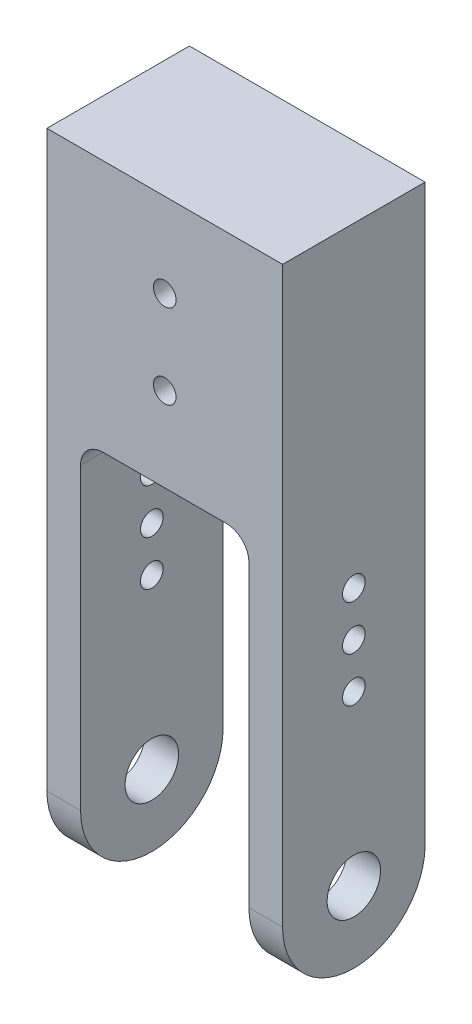
ISO-10303-21;
HEADER;
FILE_DESCRIPTION(('STEP AP214'),'2;1');
FILE_NAME('part.step','',(''),(''),'','','');
FILE_SCHEMA(('AUTOMOTIVE_DESIGN { 1 0 10303 214 1 1 1 1 }'));
ENDSEC;
DATA;
#1=APPLICATION_CONTEXT('core data for automotive mechanical design processes');
#2=APPLICATION_PROTOCOL_DEFINITION('international standard','automotive_design',2000,#1);
#3=PRODUCT_CONTEXT('',#1,'mechanical');
#4=PRODUCT('Part','Part','',(#3));
#5=PRODUCT_RELATED_PRODUCT_CATEGORY('part','',(#4));
#6=PRODUCT_DEFINITION_FORMATION('','',#4);
#7=PRODUCT_DEFINITION_CONTEXT('part definition',#1,'design');
#8=PRODUCT_DEFINITION('design','',#6,#7);
#9=PRODUCT_DEFINITION_SHAPE('','',#8);
#10=(LENGTH_UNIT() NAMED_UNIT(*) SI_UNIT(.MILLI.,.METRE.));
#11=(NAMED_UNIT(*) PLANE_ANGLE_UNIT() SI_UNIT($,.RADIAN.));
#12=(NAMED_UNIT(*) SI_UNIT($,.STERADIAN.) SOLID_ANGLE_UNIT());
#13=UNCERTAINTY_MEASURE_WITH_UNIT(LENGTH_MEASURE(1.E-05),#10,'distance_accuracy_value','');
#14=(GEOMETRIC_REPRESENTATION_CONTEXT(3) GLOBAL_UNCERTAINTY_ASSIGNED_CONTEXT((#13)) GLOBAL_UNIT_ASSIGNED_CONTEXT((#10,
#11,#12)) REPRESENTATION_CONTEXT('',''));
#15=CARTESIAN_POINT('',(0.,0.,0.));
#16=DIRECTION('',(0.,0.,1.));
#17=DIRECTION('',(1.,0.,0.));
#18=AXIS2_PLACEMENT_3D('',#15,#16,#17);
#19=CARTESIAN_POINT('',(21.,0.,-12.7));
#20=DIRECTION('',(0.,-1.,0.));
#21=DIRECTION('',(0.,0.,-1.));
#22=AXIS2_PLACEMENT_3D('',#19,#20,#21);
#23=PLANE('',#22);
#24=DIRECTION('',(-1.,0.,0.));
#25=VECTOR('',#24,1.);
#26=CARTESIAN_POINT('',(-21.,0.,-12.7));
#27=LINE('',#26,#25);
#28=CARTESIAN_POINT('',(11.,0.,-12.7));
#29=VERTEX_POINT('',#28);
#30=CARTESIAN_POINT('',(-11.,0.,-12.7));
#31=VERTEX_POINT('',#30);
#32=EDGE_CURVE('E175',#29,#31,#27,.T.);
#33=ORIENTED_EDGE('',*,*,#32,.F.);
#34=DIRECTION('',(0.,0.,-1.));
#35=VECTOR('',#34,1.);
#36=CARTESIAN_POINT('',(11.,0.,-12.7));
#37=LINE('',#36,#35);
#38=CARTESIAN_POINT('',(11.,0.,12.7));
#39=VERTEX_POINT('',#38);
#40=EDGE_CURVE('E258',#29,#39,#37,.F.);
#41=ORIENTED_EDGE('',*,*,#40,.T.);
#42=DIRECTION('',(1.,0.,0.));
#43=VECTOR('',#42,1.);
#44=CARTESIAN_POINT('',(-21.,0.,12.7));
#45=LINE('',#44,#43);
#46=CARTESIAN_POINT('',(-11.,0.,12.7));
#47=VERTEX_POINT('',#46);
#48=EDGE_CURVE('E253',#47,#39,#45,.T.);
#49=ORIENTED_EDGE('',*,*,#48,.F.);
#50=DIRECTION('',(0.,0.,1.));
#51=VECTOR('',#50,1.);
#52=CARTESIAN_POINT('',(-11.,0.,-12.7));
#53=LINE('',#52,#51);
#54=EDGE_CURVE('E256',#47,#31,#53,.F.);
#55=ORIENTED_EDGE('',*,*,#54,.T.);
#56=EDGE_LOOP('',(#33,#41,#49,#55));
#57=FACE_BOUND('',#56,.T.);
#58=ADVANCED_FACE('F34',(#57),#23,.T.);
#59=CARTESIAN_POINT('',(21.,70.,12.7));
#60=DIRECTION('',(-1.,0.,0.));
#61=DIRECTION('',(0.,0.,1.));
#62=AXIS2_PLACEMENT_3D('',#59,#60,#61);
#63=PLANE('',#62);
#64=CARTESIAN_POINT('',(21.,-11.3,0.));
#65=DIRECTION('',(1.,0.,0.));
#66=DIRECTION('',(0.,0.,-1.));
#67=AXIS2_PLACEMENT_3D('',#64,#65,#66);
#68=CIRCLE('',#67,2.01929999999999);
#69=CARTESIAN_POINT('',(21.,-11.3,-2.01929999999999));
#70=VERTEX_POINT('',#69);
#71=EDGE_CURVE('E573',#70,#70,#68,.T.);
#72=ORIENTED_EDGE('',*,*,#71,.F.);
#73=EDGE_LOOP('',(#72));
#74=FACE_BOUND('',#73,.T.);
#75=CARTESIAN_POINT('',(21.,-19.3,0.));
#76=DIRECTION('',(1.,0.,0.));
#77=DIRECTION('',(0.,0.,-1.));
#78=AXIS2_PLACEMENT_3D('',#75,#76,#77);
#79=CIRCLE('',#78,2.01929999999999);
#80=CARTESIAN_POINT('',(21.,-19.3,-2.01929999999999));
#81=VERTEX_POINT('',#80);
#82=EDGE_CURVE('E205',#81,#81,#79,.T.);
#83=ORIENTED_EDGE('',*,*,#82,.F.);
#84=EDGE_LOOP('',(#83));
#85=FACE_BOUND('',#84,.T.);
#86=CARTESIAN_POINT('',(21.,-27.3,0.));
#87=DIRECTION('',(1.,0.,0.));
#88=DIRECTION('',(0.,0.,-1.));
#89=AXIS2_PLACEMENT_3D('',#86,#87,#88);
#90=CIRCLE('',#89,2.01929999999999);
#91=CARTESIAN_POINT('',(21.,-27.3,-2.01929999999999));
#92=VERTEX_POINT('',#91);
#93=EDGE_CURVE('E202',#92,#92,#90,.T.);
#94=ORIENTED_EDGE('',*,*,#93,.F.);
#95=EDGE_LOOP('',(#94));
#96=FACE_BOUND('',#95,.T.);
#97=CARTESIAN_POINT('',(21.,-57.3,0.));
#98=DIRECTION('',(-1.,0.,0.));
#99=DIRECTION('',(0.,0.,1.));
#100=AXIS2_PLACEMENT_3D('',#97,#98,#99);
#101=CIRCLE('',#100,4.7625);
#102=CARTESIAN_POINT('',(21.,-57.3,4.7625));
#103=VERTEX_POINT('',#102);
#104=EDGE_CURVE('E234',#103,#103,#101,.T.);
#105=ORIENTED_EDGE('',*,*,#104,.T.);
#106=EDGE_LOOP('',(#105));
#107=FACE_BOUND('',#106,.T.);
#108=DIRECTION('',(0.,-1.,0.));
#109=VECTOR('',#108,1.);
#110=CARTESIAN_POINT('',(21.,70.,-12.7));
#111=LINE('',#110,#109);
#112=CARTESIAN_POINT('',(21.,45.,-12.7));
#113=VERTEX_POINT('',#112);
#114=CARTESIAN_POINT('',(21.,-57.3,-12.7));
#115=VERTEX_POINT('',#114);
#116=EDGE_CURVE('E143',#113,#115,#111,.T.);
#117=ORIENTED_EDGE('',*,*,#116,.F.);
#118=DIRECTION('',(0.,0.,1.));
#119=VECTOR('',#118,1.);
#120=CARTESIAN_POINT('',(21.,45.,-12.7));
#121=LINE('',#120,#119);
#122=CARTESIAN_POINT('',(21.,45.,12.7));
#123=VERTEX_POINT('',#122);
#124=EDGE_CURVE('E124',#113,#123,#121,.T.);
#125=ORIENTED_EDGE('',*,*,#124,.T.);
#126=DIRECTION('',(0.,-1.,0.));
#127=VECTOR('',#126,1.);
#128=CARTESIAN_POINT('',(21.,70.,12.7));
#129=LINE('',#128,#127);
#130=CARTESIAN_POINT('',(21.,-57.3,12.7));
#131=VERTEX_POINT('',#130);
#132=EDGE_CURVE('E147',#123,#131,#129,.T.);
#133=ORIENTED_EDGE('',*,*,#132,.T.);
#134=CARTESIAN_POINT('',(21.,-57.3,0.));
#135=DIRECTION('',(-1.,0.,0.));
#136=DIRECTION('',(0.,0.,1.));
#137=AXIS2_PLACEMENT_3D('',#134,#135,#136);
#138=CIRCLE('',#137,12.7);
#139=CARTESIAN_POINT('',(21.,-70.,0.));
#140=VERTEX_POINT('',#139);
#141=EDGE_CURVE('E172',#131,#140,#138,.F.);
#142=ORIENTED_EDGE('',*,*,#141,.T.);
#143=CARTESIAN_POINT('',(21.,-57.3,0.));
#144=DIRECTION('',(-1.,0.,0.));
#145=DIRECTION('',(0.,0.,1.));
#146=AXIS2_PLACEMENT_3D('',#143,#144,#145);
#147=CIRCLE('',#146,12.7);
#148=EDGE_CURVE('E169',#140,#115,#147,.F.);
#149=ORIENTED_EDGE('',*,*,#148,.T.);
#150=EDGE_LOOP('',(#117,#125,#133,#142,#149));
#151=FACE_BOUND('',#150,.T.);
#152=ADVANCED_FACE('F292',(#74,#85,#96,#107,#151),#63,.F.);
#153=CARTESIAN_POINT('',(-21.,70.,-12.7));
#154=DIRECTION('',(0.,0.,1.));
#155=DIRECTION('',(1.,0.,0.));
#156=AXIS2_PLACEMENT_3D('',#153,#154,#155);
#157=PLANE('',#156);
#158=CARTESIAN_POINT('',(0.,30.,-12.7));
#159=DIRECTION('',(0.,0.,1.));
#160=DIRECTION('',(1.,0.,0.));
#161=AXIS2_PLACEMENT_3D('',#158,#159,#160);
#162=CIRCLE('',#161,2.01929999999999);
#163=CARTESIAN_POINT('',(2.0193,30.,-12.7));
#164=VERTEX_POINT('',#163);
#165=EDGE_CURVE('E224',#164,#164,#162,.T.);
#166=ORIENTED_EDGE('',*,*,#165,.T.);
#167=EDGE_LOOP('',(#166));
#168=FACE_BOUND('',#167,.T.);
#169=CARTESIAN_POINT('',(0.,15.,-12.7));
#170=DIRECTION('',(0.,0.,1.));
#171=DIRECTION('',(1.,0.,0.));
#172=AXIS2_PLACEMENT_3D('',#169,#170,#171);
#173=CIRCLE('',#172,2.01929999999999);
#174=CARTESIAN_POINT('',(2.0193,15.,-12.7));
#175=VERTEX_POINT('',#174);
#176=EDGE_CURVE('E230',#175,#175,#173,.T.);
#177=ORIENTED_EDGE('',*,*,#176,.T.);
#178=EDGE_LOOP('',(#177));
#179=FACE_BOUND('',#178,.T.);
#180=DIRECTION('',(0.,-1.,0.));
#181=VECTOR('',#180,1.);
#182=CARTESIAN_POINT('',(-21.,70.,-12.7));
#183=LINE('',#182,#181);
#184=CARTESIAN_POINT('',(-21.,45.,-12.7));
#185=VERTEX_POINT('',#184);
#186=CARTESIAN_POINT('',(-21.,-57.3,-12.7));
#187=VERTEX_POINT('',#186);
#188=EDGE_CURVE('E133',#185,#187,#183,.T.);
#189=ORIENTED_EDGE('',*,*,#188,.F.);
#190=DIRECTION('',(1.,0.,0.));
#191=VECTOR('',#190,1.);
#192=CARTESIAN_POINT('',(21.,45.,-12.7));
#193=LINE('',#192,#191);
#194=EDGE_CURVE('E121',#185,#113,#193,.T.);
#195=ORIENTED_EDGE('',*,*,#194,.T.);
#196=ORIENTED_EDGE('',*,*,#116,.T.);
#197=DIRECTION('',(1.,0.,0.));
#198=VECTOR('',#197,1.);
#199=CARTESIAN_POINT('',(-21.,-57.3,-12.7));
#200=LINE('',#199,#198);
#201=CARTESIAN_POINT('',(15.,-57.3,-12.7));
#202=VERTEX_POINT('',#201);
#203=EDGE_CURVE('E177',#115,#202,#200,.F.);
#204=ORIENTED_EDGE('',*,*,#203,.T.);
#205=DIRECTION('',(0.,1.,0.));
#206=VECTOR('',#205,1.);
#207=CARTESIAN_POINT('',(15.,-70.,-12.7));
#208=LINE('',#207,#206);
#209=CARTESIAN_POINT('',(15.,-4.,-12.7));
#210=VERTEX_POINT('',#209);
#211=EDGE_CURVE('E243',#202,#210,#208,.T.);
#212=ORIENTED_EDGE('',*,*,#211,.T.);
#213=CARTESIAN_POINT('',(11.,-4.,-12.7));
#214=DIRECTION('',(0.,0.,1.));
#215=DIRECTION('',(1.,0.,0.));
#216=AXIS2_PLACEMENT_3D('',#213,#214,#215);
#217=CIRCLE('',#216,4.);
#218=EDGE_CURVE('E263',#210,#29,#217,.T.);
#219=ORIENTED_EDGE('',*,*,#218,.T.);
#220=ORIENTED_EDGE('',*,*,#32,.T.);
#221=CARTESIAN_POINT('',(-11.,-4.,-12.7));
#222=DIRECTION('',(0.,0.,1.));
#223=DIRECTION('',(1.,0.,0.));
#224=AXIS2_PLACEMENT_3D('',#221,#222,#223);
#225=CIRCLE('',#224,4.);
#226=CARTESIAN_POINT('',(-15.,-4.,-12.7));
#227=VERTEX_POINT('',#226);
#228=EDGE_CURVE('E270',#31,#227,#225,.T.);
#229=ORIENTED_EDGE('',*,*,#228,.T.);
#230=DIRECTION('',(0.,1.,0.));
#231=VECTOR('',#230,1.);
#232=CARTESIAN_POINT('',(-15.,-70.,-12.7));
#233=LINE('',#232,#231);
#234=CARTESIAN_POINT('',(-15.,-57.3,-12.7));
#235=VERTEX_POINT('',#234);
#236=EDGE_CURVE('E159',#235,#227,#233,.T.);
#237=ORIENTED_EDGE('',*,*,#236,.F.);
#238=DIRECTION('',(1.,0.,0.));
#239=VECTOR('',#238,1.);
#240=CARTESIAN_POINT('',(-21.,-57.3,-12.7));
#241=LINE('',#240,#239);
#242=EDGE_CURVE('E141',#235,#187,#241,.F.);
#243=ORIENTED_EDGE('',*,*,#242,.T.);
#244=EDGE_LOOP('',(#189,#195,#196,#204,#212,#219,#220,#229,#237,#243));
#245=FACE_BOUND('',#244,.T.);
#246=ADVANCED_FACE('F138',(#168,#179,#245),#157,.F.);
#247=CARTESIAN_POINT('',(-21.,70.,12.7));
#248=DIRECTION('',(1.,0.,0.));
#249=DIRECTION('',(0.,0.,-1.));
#250=AXIS2_PLACEMENT_3D('',#247,#248,#249);
#251=PLANE('',#250);
#252=CARTESIAN_POINT('',(-21.,-11.3,0.));
#253=DIRECTION('',(1.,0.,0.));
#254=DIRECTION('',(0.,0.,-1.));
#255=AXIS2_PLACEMENT_3D('',#252,#253,#254);
#256=CIRCLE('',#255,2.01929999999999);
#257=CARTESIAN_POINT('',(-21.,-11.3,-2.01929999999999));
#258=VERTEX_POINT('',#257);
#259=EDGE_CURVE('E568',#258,#258,#256,.T.);
#260=ORIENTED_EDGE('',*,*,#259,.T.);
#261=EDGE_LOOP('',(#260));
#262=FACE_BOUND('',#261,.T.);
#263=CARTESIAN_POINT('',(-21.,-19.3,0.));
#264=DIRECTION('',(1.,0.,0.));
#265=DIRECTION('',(0.,0.,-1.));
#266=AXIS2_PLACEMENT_3D('',#263,#264,#265);
#267=CIRCLE('',#266,2.01929999999999);
#268=CARTESIAN_POINT('',(-21.,-19.3,-2.01929999999999));
#269=VERTEX_POINT('',#268);
#270=EDGE_CURVE('E198',#269,#269,#267,.T.);
#271=ORIENTED_EDGE('',*,*,#270,.T.);
#272=EDGE_LOOP('',(#271));
#273=FACE_BOUND('',#272,.T.);
#274=CARTESIAN_POINT('',(-21.,-27.3,0.));
#275=DIRECTION('',(1.,0.,0.));
#276=DIRECTION('',(0.,0.,-1.));
#277=AXIS2_PLACEMENT_3D('',#274,#275,#276);
#278=CIRCLE('',#277,2.01929999999999);
#279=CARTESIAN_POINT('',(-21.,-27.3,-2.01929999999999));
#280=VERTEX_POINT('',#279);
#281=EDGE_CURVE('E194',#280,#280,#278,.T.);
#282=ORIENTED_EDGE('',*,*,#281,.T.);
#283=EDGE_LOOP('',(#282));
#284=FACE_BOUND('',#283,.T.);
#285=CARTESIAN_POINT('',(-21.,-57.3,0.));
#286=DIRECTION('',(-1.,0.,0.));
#287=DIRECTION('',(0.,0.,1.));
#288=AXIS2_PLACEMENT_3D('',#285,#286,#287);
#289=CIRCLE('',#288,4.7625);
#290=CARTESIAN_POINT('',(-21.,-57.3,4.7625));
#291=VERTEX_POINT('',#290);
#292=EDGE_CURVE('E233',#291,#291,#289,.T.);
#293=ORIENTED_EDGE('',*,*,#292,.F.);
#294=EDGE_LOOP('',(#293));
#295=FACE_BOUND('',#294,.T.);
#296=DIRECTION('',(0.,-1.,0.));
#297=VECTOR('',#296,1.);
#298=CARTESIAN_POINT('',(-21.,70.,12.7));
#299=LINE('',#298,#297);
#300=CARTESIAN_POINT('',(-21.,45.,12.7));
#301=VERTEX_POINT('',#300);
#302=CARTESIAN_POINT('',(-21.,-57.3,12.7));
#303=VERTEX_POINT('',#302);
#304=EDGE_CURVE('E136',#301,#303,#299,.T.);
#305=ORIENTED_EDGE('',*,*,#304,.F.);
#306=DIRECTION('',(0.,0.,1.));
#307=VECTOR('',#306,1.);
#308=CARTESIAN_POINT('',(-21.,45.,-12.7));
#309=LINE('',#308,#307);
#310=EDGE_CURVE('E51',#185,#301,#309,.T.);
#311=ORIENTED_EDGE('',*,*,#310,.F.);
#312=ORIENTED_EDGE('',*,*,#188,.T.);
#313=CARTESIAN_POINT('',(-21.,-57.3,0.));
#314=DIRECTION('',(1.,0.,0.));
#315=DIRECTION('',(0.,0.,-1.));
#316=AXIS2_PLACEMENT_3D('',#313,#314,#315);
#317=CIRCLE('',#316,12.7);
#318=CARTESIAN_POINT('',(-21.,-70.,0.));
#319=VERTEX_POINT('',#318);
#320=EDGE_CURVE('E179',#187,#319,#317,.F.);
#321=ORIENTED_EDGE('',*,*,#320,.T.);
#322=CARTESIAN_POINT('',(-21.,-57.3,0.));
#323=DIRECTION('',(1.,0.,0.));
#324=DIRECTION('',(0.,0.,-1.));
#325=AXIS2_PLACEMENT_3D('',#322,#323,#324);
#326=CIRCLE('',#325,12.7);
#327=EDGE_CURVE('E181',#319,#303,#326,.F.);
#328=ORIENTED_EDGE('',*,*,#327,.T.);
#329=EDGE_LOOP('',(#305,#311,#312,#321,#328));
#330=FACE_BOUND('',#329,.T.);
#331=ADVANCED_FACE('F132',(#262,#273,#284,#295,#330),#251,.F.);
#332=CARTESIAN_POINT('',(-21.,70.,12.7));
#333=DIRECTION('',(0.,0.,-1.));
#334=DIRECTION('',(-1.,0.,0.));
#335=AXIS2_PLACEMENT_3D('',#332,#333,#334);
#336=PLANE('',#335);
#337=CARTESIAN_POINT('',(0.,30.,12.7));
#338=DIRECTION('',(0.,0.,1.));
#339=DIRECTION('',(1.,0.,0.));
#340=AXIS2_PLACEMENT_3D('',#337,#338,#339);
#341=CIRCLE('',#340,2.01929999999999);
#342=CARTESIAN_POINT('',(2.01929999999999,30.,12.7));
#343=VERTEX_POINT('',#342);
#344=EDGE_CURVE('E187',#343,#343,#341,.T.);
#345=ORIENTED_EDGE('',*,*,#344,.F.);
#346=EDGE_LOOP('',(#345));
#347=FACE_BOUND('',#346,.T.);
#348=CARTESIAN_POINT('',(0.,15.,12.7));
#349=DIRECTION('',(0.,0.,1.));
#350=DIRECTION('',(1.,0.,0.));
#351=AXIS2_PLACEMENT_3D('',#348,#349,#350);
#352=CIRCLE('',#351,2.01929999999999);
#353=CARTESIAN_POINT('',(2.01929999999999,15.,12.7));
#354=VERTEX_POINT('',#353);
#355=EDGE_CURVE('E227',#354,#354,#352,.T.);
#356=ORIENTED_EDGE('',*,*,#355,.F.);
#357=EDGE_LOOP('',(#356));
#358=FACE_BOUND('',#357,.T.);
#359=ORIENTED_EDGE('',*,*,#132,.F.);
#360=DIRECTION('',(1.,0.,0.));
#361=VECTOR('',#360,1.);
#362=CARTESIAN_POINT('',(21.,45.,12.7));
#363=LINE('',#362,#361);
#364=EDGE_CURVE('E128',#301,#123,#363,.T.);
#365=ORIENTED_EDGE('',*,*,#364,.F.);
#366=ORIENTED_EDGE('',*,*,#304,.T.);
#367=DIRECTION('',(-1.,0.,0.));
#368=VECTOR('',#367,1.);
#369=CARTESIAN_POINT('',(-15.,-57.3,12.7));
#370=LINE('',#369,#368);
#371=CARTESIAN_POINT('',(-15.,-57.3,12.7));
#372=VERTEX_POINT('',#371);
#373=EDGE_CURVE('E163',#303,#372,#370,.F.);
#374=ORIENTED_EDGE('',*,*,#373,.T.);
#375=DIRECTION('',(0.,1.,0.));
#376=VECTOR('',#375,1.);
#377=CARTESIAN_POINT('',(-15.,-70.,12.7));
#378=LINE('',#377,#376);
#379=CARTESIAN_POINT('',(-15.,-4.,12.7));
#380=VERTEX_POINT('',#379);
#381=EDGE_CURVE('E156',#372,#380,#378,.T.);
#382=ORIENTED_EDGE('',*,*,#381,.T.);
#383=CARTESIAN_POINT('',(-11.,-4.,12.7));
#384=DIRECTION('',(0.,0.,-1.));
#385=DIRECTION('',(-1.,0.,0.));
#386=AXIS2_PLACEMENT_3D('',#383,#384,#385);
#387=CIRCLE('',#386,4.);
#388=EDGE_CURVE('E268',#380,#47,#387,.T.);
#389=ORIENTED_EDGE('',*,*,#388,.T.);
#390=ORIENTED_EDGE('',*,*,#48,.T.);
#391=CARTESIAN_POINT('',(11.,-4.,12.7));
#392=DIRECTION('',(0.,0.,-1.));
#393=DIRECTION('',(-1.,0.,0.));
#394=AXIS2_PLACEMENT_3D('',#391,#392,#393);
#395=CIRCLE('',#394,4.);
#396=CARTESIAN_POINT('',(15.,-4.,12.7));
#397=VERTEX_POINT('',#396);
#398=EDGE_CURVE('E265',#39,#397,#395,.T.);
#399=ORIENTED_EDGE('',*,*,#398,.T.);
#400=DIRECTION('',(0.,1.,0.));
#401=VECTOR('',#400,1.);
#402=CARTESIAN_POINT('',(15.,-70.,12.7));
#403=LINE('',#402,#401);
#404=CARTESIAN_POINT('',(15.,-57.3,12.7));
#405=VERTEX_POINT('',#404);
#406=EDGE_CURVE('E160',#405,#397,#403,.T.);
#407=ORIENTED_EDGE('',*,*,#406,.F.);
#408=DIRECTION('',(-1.,0.,0.));
#409=VECTOR('',#408,1.);
#410=CARTESIAN_POINT('',(-21.,-57.3,12.7));
#411=LINE('',#410,#409);
#412=EDGE_CURVE('E166',#405,#131,#411,.F.);
#413=ORIENTED_EDGE('',*,*,#412,.T.);
#414=EDGE_LOOP('',(#359,#365,#366,#374,#382,#389,#390,#399,#407,#413));
#415=FACE_BOUND('',#414,.T.);
#416=ADVANCED_FACE('F285',(#347,#358,#415),#336,.F.);
#417=CARTESIAN_POINT('',(-15.,-70.,12.7));
#418=DIRECTION('',(-1.,0.,0.));
#419=DIRECTION('',(0.,0.,1.));
#420=AXIS2_PLACEMENT_3D('',#417,#418,#419);
#421=PLANE('',#420);
#422=CARTESIAN_POINT('',(-15.,-11.3,0.));
#423=DIRECTION('',(-1.,0.,0.));
#424=DIRECTION('',(0.,0.,1.));
#425=AXIS2_PLACEMENT_3D('',#422,#423,#424);
#426=CIRCLE('',#425,2.01929999999999);
#427=CARTESIAN_POINT('',(-15.,-11.3,2.01929999999999));
#428=VERTEX_POINT('',#427);
#429=EDGE_CURVE('E210',#428,#428,#426,.T.);
#430=ORIENTED_EDGE('',*,*,#429,.T.);
#431=EDGE_LOOP('',(#430));
#432=FACE_BOUND('',#431,.T.);
#433=CARTESIAN_POINT('',(-15.,-19.3,0.));
#434=DIRECTION('',(-1.,0.,0.));
#435=DIRECTION('',(0.,0.,1.));
#436=AXIS2_PLACEMENT_3D('',#433,#434,#435);
#437=CIRCLE('',#436,2.01929999999999);
#438=CARTESIAN_POINT('',(-15.,-19.3,2.01929999999999));
#439=VERTEX_POINT('',#438);
#440=EDGE_CURVE('E197',#439,#439,#437,.T.);
#441=ORIENTED_EDGE('',*,*,#440,.T.);
#442=EDGE_LOOP('',(#441));
#443=FACE_BOUND('',#442,.T.);
#444=CARTESIAN_POINT('',(-15.,-27.3,0.));
#445=DIRECTION('',(-1.,0.,0.));
#446=DIRECTION('',(0.,0.,1.));
#447=AXIS2_PLACEMENT_3D('',#444,#445,#446);
#448=CIRCLE('',#447,2.01929999999999);
#449=CARTESIAN_POINT('',(-15.,-27.3,2.01929999999999));
#450=VERTEX_POINT('',#449);
#451=EDGE_CURVE('E193',#450,#450,#448,.T.);
#452=ORIENTED_EDGE('',*,*,#451,.T.);
#453=EDGE_LOOP('',(#452));
#454=FACE_BOUND('',#453,.T.);
#455=CARTESIAN_POINT('',(-15.,-57.3,0.));
#456=DIRECTION('',(-1.,0.,0.));
#457=DIRECTION('',(0.,0.,1.));
#458=AXIS2_PLACEMENT_3D('',#455,#456,#457);
#459=CIRCLE('',#458,4.7625);
#460=CARTESIAN_POINT('',(-15.,-57.3,4.7625));
#461=VERTEX_POINT('',#460);
#462=EDGE_CURVE('E240',#461,#461,#459,.T.);
#463=ORIENTED_EDGE('',*,*,#462,.T.);
#464=EDGE_LOOP('',(#463));
#465=FACE_BOUND('',#464,.T.);
#466=ORIENTED_EDGE('',*,*,#381,.F.);
#467=CARTESIAN_POINT('',(-15.,-57.3,0.));
#468=DIRECTION('',(-1.,0.,0.));
#469=DIRECTION('',(0.,0.,1.));
#470=AXIS2_PLACEMENT_3D('',#467,#468,#469);
#471=CIRCLE('',#470,12.7);
#472=CARTESIAN_POINT('',(-15.,-70.,0.));
#473=VERTEX_POINT('',#472);
#474=EDGE_CURVE('E11',#372,#473,#471,.F.);
#475=ORIENTED_EDGE('',*,*,#474,.T.);
#476=CARTESIAN_POINT('',(-15.,-57.3,0.));
#477=DIRECTION('',(-1.,0.,0.));
#478=DIRECTION('',(0.,0.,1.));
#479=AXIS2_PLACEMENT_3D('',#476,#477,#478);
#480=CIRCLE('',#479,12.7);
#481=EDGE_CURVE('E43',#473,#235,#480,.F.);
#482=ORIENTED_EDGE('',*,*,#481,.T.);
#483=ORIENTED_EDGE('',*,*,#236,.T.);
#484=DIRECTION('',(0.,0.,1.));
#485=VECTOR('',#484,1.);
#486=CARTESIAN_POINT('',(-15.,-4.,12.7));
#487=LINE('',#486,#485);
#488=EDGE_CURVE('E260',#227,#380,#487,.T.);
#489=ORIENTED_EDGE('',*,*,#488,.T.);
#490=EDGE_LOOP('',(#466,#475,#482,#483,#489));
#491=FACE_BOUND('',#490,.T.);
#492=ADVANCED_FACE('F315',(#432,#443,#454,#465,#491),#421,.F.);
#493=CARTESIAN_POINT('',(15.,-70.,12.7));
#494=DIRECTION('',(1.,0.,0.));
#495=DIRECTION('',(0.,0.,-1.));
#496=AXIS2_PLACEMENT_3D('',#493,#494,#495);
#497=PLANE('',#496);
#498=CARTESIAN_POINT('',(15.,-11.3,0.));
#499=DIRECTION('',(1.,0.,0.));
#500=DIRECTION('',(0.,0.,-1.));
#501=AXIS2_PLACEMENT_3D('',#498,#499,#500);
#502=CIRCLE('',#501,2.01929999999999);
#503=CARTESIAN_POINT('',(15.,-11.3,-2.01929999999999));
#504=VERTEX_POINT('',#503);
#505=EDGE_CURVE('E38',#504,#504,#502,.T.);
#506=ORIENTED_EDGE('',*,*,#505,.T.);
#507=EDGE_LOOP('',(#506));
#508=FACE_BOUND('',#507,.T.);
#509=CARTESIAN_POINT('',(15.,-19.3,0.));
#510=DIRECTION('',(1.,0.,0.));
#511=DIRECTION('',(0.,0.,-1.));
#512=AXIS2_PLACEMENT_3D('',#509,#510,#511);
#513=CIRCLE('',#512,2.01929999999999);
#514=CARTESIAN_POINT('',(15.,-19.3,-2.01929999999999));
#515=VERTEX_POINT('',#514);
#516=EDGE_CURVE('E195',#515,#515,#513,.T.);
#517=ORIENTED_EDGE('',*,*,#516,.T.);
#518=EDGE_LOOP('',(#517));
#519=FACE_BOUND('',#518,.T.);
#520=CARTESIAN_POINT('',(15.,-27.3,0.));
#521=DIRECTION('',(1.,0.,0.));
#522=DIRECTION('',(0.,0.,-1.));
#523=AXIS2_PLACEMENT_3D('',#520,#521,#522);
#524=CIRCLE('',#523,2.01929999999999);
#525=CARTESIAN_POINT('',(15.,-27.3,-2.01929999999999));
#526=VERTEX_POINT('',#525);
#527=EDGE_CURVE('E191',#526,#526,#524,.T.);
#528=ORIENTED_EDGE('',*,*,#527,.T.);
#529=EDGE_LOOP('',(#528));
#530=FACE_BOUND('',#529,.T.);
#531=CARTESIAN_POINT('',(15.,-57.3,0.));
#532=DIRECTION('',(1.,0.,0.));
#533=DIRECTION('',(0.,0.,-1.));
#534=AXIS2_PLACEMENT_3D('',#531,#532,#533);
#535=CIRCLE('',#534,4.7625);
#536=CARTESIAN_POINT('',(15.,-57.3,4.7625));
#537=VERTEX_POINT('',#536);
#538=EDGE_CURVE('E237',#537,#537,#535,.T.);
#539=ORIENTED_EDGE('',*,*,#538,.T.);
#540=EDGE_LOOP('',(#539));
#541=FACE_BOUND('',#540,.T.);
#542=CARTESIAN_POINT('',(15.,-57.3,0.));
#543=DIRECTION('',(1.,0.,0.));
#544=DIRECTION('',(0.,0.,-1.));
#545=AXIS2_PLACEMENT_3D('',#542,#543,#544);
#546=CIRCLE('',#545,12.7);
#547=CARTESIAN_POINT('',(15.,-70.,0.));
#548=VERTEX_POINT('',#547);
#549=EDGE_CURVE('E272',#202,#548,#546,.F.);
#550=ORIENTED_EDGE('',*,*,#549,.T.);
#551=CARTESIAN_POINT('',(15.,-57.3,0.));
#552=DIRECTION('',(1.,0.,0.));
#553=DIRECTION('',(0.,0.,-1.));
#554=AXIS2_PLACEMENT_3D('',#551,#552,#553);
#555=CIRCLE('',#554,12.7);
#556=EDGE_CURVE('E161',#548,#405,#555,.F.);
#557=ORIENTED_EDGE('',*,*,#556,.T.);
#558=ORIENTED_EDGE('',*,*,#406,.T.);
#559=DIRECTION('',(0.,0.,-1.));
#560=VECTOR('',#559,1.);
#561=CARTESIAN_POINT('',(15.,-4.,12.7));
#562=LINE('',#561,#560);
#563=EDGE_CURVE('E145',#397,#210,#562,.T.);
#564=ORIENTED_EDGE('',*,*,#563,.T.);
#565=ORIENTED_EDGE('',*,*,#211,.F.);
#566=EDGE_LOOP('',(#550,#557,#558,#564,#565));
#567=FACE_BOUND('',#566,.T.);
#568=ADVANCED_FACE('F279',(#508,#519,#530,#541,#567),#497,.F.);
#569=CARTESIAN_POINT('',(21.,-57.3,0.));
#570=DIRECTION('',(-1.,0.,0.));
#571=DIRECTION('',(0.,0.,1.));
#572=AXIS2_PLACEMENT_3D('',#569,#570,#571);
#573=CYLINDRICAL_SURFACE('',#572,4.7625);
#574=CARTESIAN_POINT('',(21.,-57.3,4.7625));
#575=CARTESIAN_POINT('',(20.9375,-57.3,4.7625));
#576=CARTESIAN_POINT('',(20.875,-57.3,4.7625));
#577=CARTESIAN_POINT('',(20.75,-57.3,4.7625));
#578=CARTESIAN_POINT('',(20.6875,-57.3,4.7625));
#579=CARTESIAN_POINT('',(20.5625,-57.3,4.7625));
#580=CARTESIAN_POINT('',(20.5,-57.3,4.7625));
#581=CARTESIAN_POINT('',(20.375,-57.3,4.7625));
#582=CARTESIAN_POINT('',(20.3125,-57.3,4.7625));
#583=CARTESIAN_POINT('',(20.1875,-57.3,4.7625));
#584=CARTESIAN_POINT('',(20.125,-57.3,4.7625));
#585=CARTESIAN_POINT('',(20.,-57.3,4.7625));
#586=CARTESIAN_POINT('',(19.9375,-57.3,4.7625));
#587=CARTESIAN_POINT('',(19.8125,-57.3,4.7625));
#588=CARTESIAN_POINT('',(19.75,-57.3,4.7625));
#589=CARTESIAN_POINT('',(19.625,-57.3,4.7625));
#590=CARTESIAN_POINT('',(19.5625,-57.3,4.7625));
#591=CARTESIAN_POINT('',(19.4375,-57.3,4.7625));
#592=CARTESIAN_POINT('',(19.375,-57.3,4.7625));
#593=CARTESIAN_POINT('',(19.25,-57.3,4.7625));
#594=CARTESIAN_POINT('',(19.1875,-57.3,4.7625));
#595=CARTESIAN_POINT('',(19.0625,-57.3,4.7625));
#596=CARTESIAN_POINT('',(19.,-57.3,4.7625));
#597=CARTESIAN_POINT('',(18.875,-57.3,4.7625));
#598=CARTESIAN_POINT('',(18.8125,-57.3,4.7625));
#599=CARTESIAN_POINT('',(18.6875,-57.3,4.7625));
#600=CARTESIAN_POINT('',(18.625,-57.3,4.7625));
#601=CARTESIAN_POINT('',(18.5,-57.3,4.7625));
#602=CARTESIAN_POINT('',(18.4375,-57.3,4.7625));
#603=CARTESIAN_POINT('',(18.3125,-57.3,4.7625));
#604=CARTESIAN_POINT('',(18.25,-57.3,4.7625));
#605=CARTESIAN_POINT('',(18.125,-57.3,4.7625));
#606=CARTESIAN_POINT('',(18.0625,-57.3,4.7625));
#607=CARTESIAN_POINT('',(17.9375,-57.3,4.7625));
#608=CARTESIAN_POINT('',(17.875,-57.3,4.7625));
#609=CARTESIAN_POINT('',(17.75,-57.3,4.7625));
#610=CARTESIAN_POINT('',(17.6875,-57.3,4.7625));
#611=CARTESIAN_POINT('',(17.5625,-57.3,4.7625));
#612=CARTESIAN_POINT('',(17.5,-57.3,4.7625));
#613=CARTESIAN_POINT('',(17.375,-57.3,4.7625));
#614=CARTESIAN_POINT('',(17.3125,-57.3,4.7625));
#615=CARTESIAN_POINT('',(17.1875,-57.3,4.7625));
#616=CARTESIAN_POINT('',(17.125,-57.3,4.7625));
#617=CARTESIAN_POINT('',(17.,-57.3,4.7625));
#618=CARTESIAN_POINT('',(16.9375,-57.3,4.7625));
#619=CARTESIAN_POINT('',(16.8125,-57.3,4.7625));
#620=CARTESIAN_POINT('',(16.75,-57.3,4.7625));
#621=CARTESIAN_POINT('',(16.625,-57.3,4.7625));
#622=CARTESIAN_POINT('',(16.5625,-57.3,4.7625));
#623=CARTESIAN_POINT('',(16.4375,-57.3,4.7625));
#624=CARTESIAN_POINT('',(16.375,-57.3,4.7625));
#625=CARTESIAN_POINT('',(16.25,-57.3,4.7625));
#626=CARTESIAN_POINT('',(16.1875,-57.3,4.7625));
#627=CARTESIAN_POINT('',(16.0625,-57.3,4.7625));
#628=CARTESIAN_POINT('',(16.,-57.3,4.7625));
#629=CARTESIAN_POINT('',(15.875,-57.3,4.7625));
#630=CARTESIAN_POINT('',(15.8125,-57.3,4.7625));
#631=CARTESIAN_POINT('',(15.6875,-57.3,4.7625));
#632=CARTESIAN_POINT('',(15.625,-57.3,4.7625));
#633=CARTESIAN_POINT('',(15.5,-57.3,4.7625));
#634=CARTESIAN_POINT('',(15.4375,-57.3,4.7625));
#635=CARTESIAN_POINT('',(15.3125,-57.3,4.7625));
#636=CARTESIAN_POINT('',(15.25,-57.3,4.7625));
#637=CARTESIAN_POINT('',(15.125,-57.3,4.7625));
#638=CARTESIAN_POINT('',(15.0625,-57.3,4.7625));
#639=CARTESIAN_POINT('',(15.,-57.3,4.7625));
#640=B_SPLINE_CURVE_WITH_KNOTS('',3,(#574,#575,#576,#577,#578,#579,#580,#581,#582,#583,#584,
#585,#586,#587,#588,#589,#590,#591,#592,#593,#594,#595,#596,#597,#598,#599,#600,#601,#602,#603,
#604,#605,#606,#607,#608,#609,#610,#611,#612,#613,#614,#615,#616,#617,#618,#619,#620,#621,#622,
#623,#624,#625,#626,#627,#628,#629,#630,#631,#632,#633,#634,#635,#636,#637,#638,#639),
.UNSPECIFIED.,.F.,.F.,(4,2,2,2,2,2,2,2,2,2,2,2,2,2,2,2,2,2,2,2,2,2,2,2,2,2,2,2,2,2,2,2,4),(0.,
0.187500000000004,0.375000000000004,0.562500000000004,0.750000000000004,0.937500000000004,1.125,
1.3125,1.5,1.6875,1.87500000000001,2.06250000000001,2.25000000000001,2.43750000000001,
2.62500000000001,2.81250000000001,3.00000000000001,3.18750000000001,3.37500000000001,
3.56250000000001,3.75000000000001,3.93750000000001,4.12500000000001,4.31250000000001,
4.50000000000001,4.68750000000001,4.87500000000001,5.06250000000001,5.25000000000001,
5.43750000000001,5.62500000000001,5.81250000000001,6.00000000000001),.UNSPECIFIED.);
#641=EDGE_CURVE('BSEAM323',#103,#537,#640,.T.);
#642=ORIENTED_EDGE('',*,*,#104,.F.);
#643=ORIENTED_EDGE('',*,*,#538,.F.);
#644=ORIENTED_EDGE('',*,*,#641,.T.);
#645=ORIENTED_EDGE('',*,*,#641,.F.);
#646=EDGE_LOOP('',(#642,#644,#643,#645));
#647=FACE_BOUND('',#646,.T.);
#648=ADVANCED_FACE('F323',(#647),#573,.F.);
#649=CARTESIAN_POINT('',(-21.,-57.3,4.7625));
#650=CARTESIAN_POINT('',(-20.9375,-57.3,4.7625));
#651=CARTESIAN_POINT('',(-20.875,-57.3,4.7625));
#652=CARTESIAN_POINT('',(-20.75,-57.3,4.7625));
#653=CARTESIAN_POINT('',(-20.6875,-57.3,4.7625));
#654=CARTESIAN_POINT('',(-20.5625,-57.3,4.7625));
#655=CARTESIAN_POINT('',(-20.5,-57.3,4.7625));
#656=CARTESIAN_POINT('',(-20.375,-57.3,4.7625));
#657=CARTESIAN_POINT('',(-20.3125,-57.3,4.7625));
#658=CARTESIAN_POINT('',(-20.1875,-57.3,4.7625));
#659=CARTESIAN_POINT('',(-20.125,-57.3,4.7625));
#660=CARTESIAN_POINT('',(-20.,-57.3,4.7625));
#661=CARTESIAN_POINT('',(-19.9375,-57.3,4.7625));
#662=CARTESIAN_POINT('',(-19.8125,-57.3,4.7625));
#663=CARTESIAN_POINT('',(-19.75,-57.3,4.7625));
#664=CARTESIAN_POINT('',(-19.625,-57.3,4.7625));
#665=CARTESIAN_POINT('',(-19.5625,-57.3,4.7625));
#666=CARTESIAN_POINT('',(-19.4375,-57.3,4.7625));
#667=CARTESIAN_POINT('',(-19.375,-57.3,4.7625));
#668=CARTESIAN_POINT('',(-19.25,-57.3,4.7625));
#669=CARTESIAN_POINT('',(-19.1875,-57.3,4.7625));
#670=CARTESIAN_POINT('',(-19.0625,-57.3,4.7625));
#671=CARTESIAN_POINT('',(-19.,-57.3,4.7625));
#672=CARTESIAN_POINT('',(-18.875,-57.3,4.7625));
#673=CARTESIAN_POINT('',(-18.8125,-57.3,4.7625));
#674=CARTESIAN_POINT('',(-18.6875,-57.3,4.7625));
#675=CARTESIAN_POINT('',(-18.625,-57.3,4.7625));
#676=CARTESIAN_POINT('',(-18.5,-57.3,4.7625));
#677=CARTESIAN_POINT('',(-18.4375,-57.3,4.7625));
#678=CARTESIAN_POINT('',(-18.3125,-57.3,4.7625));
#679=CARTESIAN_POINT('',(-18.25,-57.3,4.7625));
#680=CARTESIAN_POINT('',(-18.125,-57.3,4.7625));
#681=CARTESIAN_POINT('',(-18.0625,-57.3,4.7625));
#682=CARTESIAN_POINT('',(-17.9375,-57.3,4.7625));
#683=CARTESIAN_POINT('',(-17.875,-57.3,4.7625));
#684=CARTESIAN_POINT('',(-17.75,-57.3,4.7625));
#685=CARTESIAN_POINT('',(-17.6875,-57.3,4.7625));
#686=CARTESIAN_POINT('',(-17.5625,-57.3,4.7625));
#687=CARTESIAN_POINT('',(-17.5,-57.3,4.7625));
#688=CARTESIAN_POINT('',(-17.375,-57.3,4.7625));
#689=CARTESIAN_POINT('',(-17.3125,-57.3,4.7625));
#690=CARTESIAN_POINT('',(-17.1875,-57.3,4.7625));
#691=CARTESIAN_POINT('',(-17.125,-57.3,4.7625));
#692=CARTESIAN_POINT('',(-17.,-57.3,4.7625));
#693=CARTESIAN_POINT('',(-16.9375,-57.3,4.7625));
#694=CARTESIAN_POINT('',(-16.8125,-57.3,4.7625));
#695=CARTESIAN_POINT('',(-16.75,-57.3,4.7625));
#696=CARTESIAN_POINT('',(-16.625,-57.3,4.7625));
#697=CARTESIAN_POINT('',(-16.5625,-57.3,4.7625));
#698=CARTESIAN_POINT('',(-16.4375,-57.3,4.7625));
#699=CARTESIAN_POINT('',(-16.375,-57.3,4.7625));
#700=CARTESIAN_POINT('',(-16.25,-57.3,4.7625));
#701=CARTESIAN_POINT('',(-16.1875,-57.3,4.7625));
#702=CARTESIAN_POINT('',(-16.0625,-57.3,4.7625));
#703=CARTESIAN_POINT('',(-16.,-57.3,4.7625));
#704=CARTESIAN_POINT('',(-15.875,-57.3,4.7625));
#705=CARTESIAN_POINT('',(-15.8125,-57.3,4.7625));
#706=CARTESIAN_POINT('',(-15.6875,-57.3,4.7625));
#707=CARTESIAN_POINT('',(-15.625,-57.3,4.7625));
#708=CARTESIAN_POINT('',(-15.5,-57.3,4.7625));
#709=CARTESIAN_POINT('',(-15.4375,-57.3,4.7625));
#710=CARTESIAN_POINT('',(-15.3125,-57.3,4.7625));
#711=CARTESIAN_POINT('',(-15.25,-57.3,4.7625));
#712=CARTESIAN_POINT('',(-15.125,-57.3,4.7625));
#713=CARTESIAN_POINT('',(-15.0625,-57.3,4.7625));
#714=CARTESIAN_POINT('',(-15.,-57.3,4.7625));
#715=B_SPLINE_CURVE_WITH_KNOTS('',3,(#649,#650,#651,#652,#653,#654,#655,#656,#657,#658,#659,
#660,#661,#662,#663,#664,#665,#666,#667,#668,#669,#670,#671,#672,#673,#674,#675,#676,#677,#678,
#679,#680,#681,#682,#683,#684,#685,#686,#687,#688,#689,#690,#691,#692,#693,#694,#695,#696,#697,
#698,#699,#700,#701,#702,#703,#704,#705,#706,#707,#708,#709,#710,#711,#712,#713,#714),
.UNSPECIFIED.,.F.,.F.,(4,2,2,2,2,2,2,2,2,2,2,2,2,2,2,2,2,2,2,2,2,2,2,2,2,2,2,2,2,2,2,2,4),(0.,
0.1875,0.375,0.5625,0.750000000000001,0.937500000000001,1.125,1.3125,1.5,1.68749999999999,
1.87499999999999,2.06249999999999,2.25,2.4375,2.625,2.8125,3.,3.1875,3.375,3.5625,3.75,3.9375,
4.125,4.3125,4.49999999999999,4.6875,4.87499999999999,5.06249999999999,5.24999999999999,
5.43749999999999,5.62499999999999,5.81249999999999,5.99999999999999),.UNSPECIFIED.);
#716=EDGE_CURVE('BSEAM346',#291,#461,#715,.T.);
#717=ORIENTED_EDGE('',*,*,#292,.T.);
#718=ORIENTED_EDGE('',*,*,#462,.F.);
#719=ORIENTED_EDGE('',*,*,#716,.T.);
#720=ORIENTED_EDGE('',*,*,#716,.F.);
#721=EDGE_LOOP('',(#717,#719,#718,#720));
#722=FACE_BOUND('',#721,.T.);
#723=ADVANCED_FACE('F346',(#722),#573,.F.);
#724=CARTESIAN_POINT('',(11.,-4.,12.7));
#725=DIRECTION('',(0.,0.,-1.));
#726=DIRECTION('',(-1.,0.,0.));
#727=AXIS2_PLACEMENT_3D('',#724,#725,#726);
#728=CYLINDRICAL_SURFACE('',#727,4.);
#729=ORIENTED_EDGE('',*,*,#398,.F.);
#730=ORIENTED_EDGE('',*,*,#40,.F.);
#731=ORIENTED_EDGE('',*,*,#218,.F.);
#732=ORIENTED_EDGE('',*,*,#563,.F.);
#733=EDGE_LOOP('',(#729,#730,#731,#732));
#734=FACE_BOUND('',#733,.T.);
#735=ADVANCED_FACE('F298',(#734),#728,.F.);
#736=CARTESIAN_POINT('',(-11.,-4.,12.7));
#737=DIRECTION('',(0.,0.,1.));
#738=DIRECTION('',(1.,0.,0.));
#739=AXIS2_PLACEMENT_3D('',#736,#737,#738);
#740=CYLINDRICAL_SURFACE('',#739,4.);
#741=ORIENTED_EDGE('',*,*,#228,.F.);
#742=ORIENTED_EDGE('',*,*,#54,.F.);
#743=ORIENTED_EDGE('',*,*,#388,.F.);
#744=ORIENTED_EDGE('',*,*,#488,.F.);
#745=EDGE_LOOP('',(#741,#742,#743,#744));
#746=FACE_BOUND('',#745,.T.);
#747=ADVANCED_FACE('F307',(#746),#740,.F.);
#748=CARTESIAN_POINT('',(0.,15.,12.7));
#749=DIRECTION('',(0.,0.,1.));
#750=DIRECTION('',(1.,0.,0.));
#751=AXIS2_PLACEMENT_3D('',#748,#749,#750);
#752=CYLINDRICAL_SURFACE('',#751,2.01929999999999);
#753=ORIENTED_EDGE('',*,*,#176,.F.);
#754=EDGE_LOOP('',(#753));
#755=FACE_BOUND('',#754,.T.);
#756=ORIENTED_EDGE('',*,*,#355,.T.);
#757=EDGE_LOOP('',(#756));
#758=FACE_BOUND('',#757,.T.);
#759=ADVANCED_FACE('F349',(#755,#758),#752,.F.);
#760=CARTESIAN_POINT('',(0.,30.,12.7));
#761=DIRECTION('',(0.,0.,1.));
#762=DIRECTION('',(1.,0.,0.));
#763=AXIS2_PLACEMENT_3D('',#760,#761,#762);
#764=CYLINDRICAL_SURFACE('',#763,2.01929999999999);
#765=ORIENTED_EDGE('',*,*,#165,.F.);
#766=EDGE_LOOP('',(#765));
#767=FACE_BOUND('',#766,.T.);
#768=ORIENTED_EDGE('',*,*,#344,.T.);
#769=EDGE_LOOP('',(#768));
#770=FACE_BOUND('',#769,.T.);
#771=ADVANCED_FACE('F353',(#767,#770),#764,.F.);
#772=CARTESIAN_POINT('',(21.,-57.3,0.));
#773=DIRECTION('',(1.,0.,0.));
#774=DIRECTION('',(0.,0.,-1.));
#775=AXIS2_PLACEMENT_3D('',#772,#773,#774);
#776=CYLINDRICAL_SURFACE('',#775,12.7);
#777=ORIENTED_EDGE('',*,*,#203,.F.);
#778=ORIENTED_EDGE('',*,*,#148,.F.);
#779=DIRECTION('',(1.,0.,0.));
#780=VECTOR('',#779,1.);
#781=CARTESIAN_POINT('',(21.,-70.,0.));
#782=LINE('',#781,#780);
#783=EDGE_CURVE('E184',#548,#140,#782,.T.);
#784=ORIENTED_EDGE('',*,*,#783,.F.);
#785=ORIENTED_EDGE('',*,*,#549,.F.);
#786=EDGE_LOOP('',(#777,#778,#784,#785));
#787=FACE_BOUND('',#786,.T.);
#788=ADVANCED_FACE('F295',(#787),#776,.T.);
#789=CARTESIAN_POINT('',(21.,-57.3,0.));
#790=DIRECTION('',(-1.,0.,0.));
#791=DIRECTION('',(0.,0.,1.));
#792=AXIS2_PLACEMENT_3D('',#789,#790,#791);
#793=CYLINDRICAL_SURFACE('',#792,12.7);
#794=ORIENTED_EDGE('',*,*,#141,.F.);
#795=ORIENTED_EDGE('',*,*,#412,.F.);
#796=ORIENTED_EDGE('',*,*,#556,.F.);
#797=ORIENTED_EDGE('',*,*,#783,.T.);
#798=EDGE_LOOP('',(#794,#795,#796,#797));
#799=FACE_BOUND('',#798,.T.);
#800=ADVANCED_FACE('F289',(#799),#793,.T.);
#801=CARTESIAN_POINT('',(-21.,-57.3,0.));
#802=DIRECTION('',(-1.,0.,0.));
#803=DIRECTION('',(0.,0.,1.));
#804=AXIS2_PLACEMENT_3D('',#801,#802,#803);
#805=CYLINDRICAL_SURFACE('',#804,12.7);
#806=ORIENTED_EDGE('',*,*,#242,.F.);
#807=ORIENTED_EDGE('',*,*,#481,.F.);
#808=DIRECTION('',(1.,0.,0.));
#809=VECTOR('',#808,1.);
#810=CARTESIAN_POINT('',(-15.,-70.,0.));
#811=LINE('',#810,#809);
#812=EDGE_CURVE('E188',#319,#473,#811,.T.);
#813=ORIENTED_EDGE('',*,*,#812,.F.);
#814=ORIENTED_EDGE('',*,*,#320,.F.);
#815=EDGE_LOOP('',(#806,#807,#813,#814));
#816=FACE_BOUND('',#815,.T.);
#817=ADVANCED_FACE('F36',(#816),#805,.T.);
#818=CARTESIAN_POINT('',(-21.,-57.3,0.));
#819=DIRECTION('',(1.,0.,0.));
#820=DIRECTION('',(0.,0.,-1.));
#821=AXIS2_PLACEMENT_3D('',#818,#819,#820);
#822=CYLINDRICAL_SURFACE('',#821,12.7);
#823=ORIENTED_EDGE('',*,*,#474,.F.);
#824=ORIENTED_EDGE('',*,*,#373,.F.);
#825=ORIENTED_EDGE('',*,*,#327,.F.);
#826=ORIENTED_EDGE('',*,*,#812,.T.);
#827=EDGE_LOOP('',(#823,#824,#825,#826));
#828=FACE_BOUND('',#827,.T.);
#829=ADVANCED_FACE('F314',(#828),#822,.T.);
#830=CARTESIAN_POINT('',(21.,45.,-12.7));
#831=DIRECTION('',(0.,-1.,0.));
#832=DIRECTION('',(0.,0.,-1.));
#833=AXIS2_PLACEMENT_3D('',#830,#831,#832);
#834=PLANE('',#833);
#835=ORIENTED_EDGE('',*,*,#364,.T.);
#836=ORIENTED_EDGE('',*,*,#124,.F.);
#837=ORIENTED_EDGE('',*,*,#194,.F.);
#838=ORIENTED_EDGE('',*,*,#310,.T.);
#839=EDGE_LOOP('',(#835,#836,#837,#838));
#840=FACE_BOUND('',#839,.T.);
#841=ADVANCED_FACE('F122',(#840),#834,.F.);
#842=CARTESIAN_POINT('',(21.,-27.3,0.));
#843=DIRECTION('',(1.,0.,0.));
#844=DIRECTION('',(0.,0.,-1.));
#845=AXIS2_PLACEMENT_3D('',#842,#843,#844);
#846=CYLINDRICAL_SURFACE('',#845,2.01929999999999);
#847=ORIENTED_EDGE('',*,*,#93,.T.);
#848=EDGE_LOOP('',(#847));
#849=FACE_BOUND('',#848,.T.);
#850=ORIENTED_EDGE('',*,*,#527,.F.);
#851=EDGE_LOOP('',(#850));
#852=FACE_BOUND('',#851,.T.);
#853=ADVANCED_FACE('F359',(#849,#852),#846,.F.);
#854=ORIENTED_EDGE('',*,*,#281,.F.);
#855=EDGE_LOOP('',(#854));
#856=FACE_BOUND('',#855,.T.);
#857=ORIENTED_EDGE('',*,*,#451,.F.);
#858=EDGE_LOOP('',(#857));
#859=FACE_BOUND('',#858,.T.);
#860=ADVANCED_FACE('F424',(#856,#859),#846,.F.);
#861=CARTESIAN_POINT('',(21.,-19.3,0.));
#862=DIRECTION('',(1.,0.,0.));
#863=DIRECTION('',(0.,0.,-1.));
#864=AXIS2_PLACEMENT_3D('',#861,#862,#863);
#865=CYLINDRICAL_SURFACE('',#864,2.01929999999999);
#866=ORIENTED_EDGE('',*,*,#82,.T.);
#867=EDGE_LOOP('',(#866));
#868=FACE_BOUND('',#867,.T.);
#869=ORIENTED_EDGE('',*,*,#516,.F.);
#870=EDGE_LOOP('',(#869));
#871=FACE_BOUND('',#870,.T.);
#872=ADVANCED_FACE('F436',(#868,#871),#865,.F.);
#873=ORIENTED_EDGE('',*,*,#270,.F.);
#874=EDGE_LOOP('',(#873));
#875=FACE_BOUND('',#874,.T.);
#876=ORIENTED_EDGE('',*,*,#440,.F.);
#877=EDGE_LOOP('',(#876));
#878=FACE_BOUND('',#877,.T.);
#879=ADVANCED_FACE('F446',(#875,#878),#865,.F.);
#880=CARTESIAN_POINT('',(21.,-11.3,0.));
#881=DIRECTION('',(1.,0.,0.));
#882=DIRECTION('',(0.,0.,-1.));
#883=AXIS2_PLACEMENT_3D('',#880,#881,#882);
#884=CYLINDRICAL_SURFACE('',#883,2.01929999999999);
#885=ORIENTED_EDGE('',*,*,#71,.T.);
#886=EDGE_LOOP('',(#885));
#887=FACE_BOUND('',#886,.T.);
#888=ORIENTED_EDGE('',*,*,#505,.F.);
#889=EDGE_LOOP('',(#888));
#890=FACE_BOUND('',#889,.T.);
#891=ADVANCED_FACE('F457',(#887,#890),#884,.F.);
#892=ORIENTED_EDGE('',*,*,#259,.F.);
#893=EDGE_LOOP('',(#892));
#894=FACE_BOUND('',#893,.T.);
#895=ORIENTED_EDGE('',*,*,#429,.F.);
#896=EDGE_LOOP('',(#895));
#897=FACE_BOUND('',#896,.T.);
#898=ADVANCED_FACE('F467',(#894,#897),#884,.F.);
#899=CLOSED_SHELL('',(#58,#152,#246,#331,#416,#492,#568,#648,#723,#735,#747,#759,#771,#788,#800,
#817,#829,#841,#853,#860,#872,#879,#891,#898));
#900=MANIFOLD_SOLID_BREP('B2',#899);
#901=ADVANCED_BREP_SHAPE_REPRESENTATION('',(#18,#900),#14);
#902=SHAPE_DEFINITION_REPRESENTATION(#9,#901);
ENDSEC;
END-ISO-10303-21;
